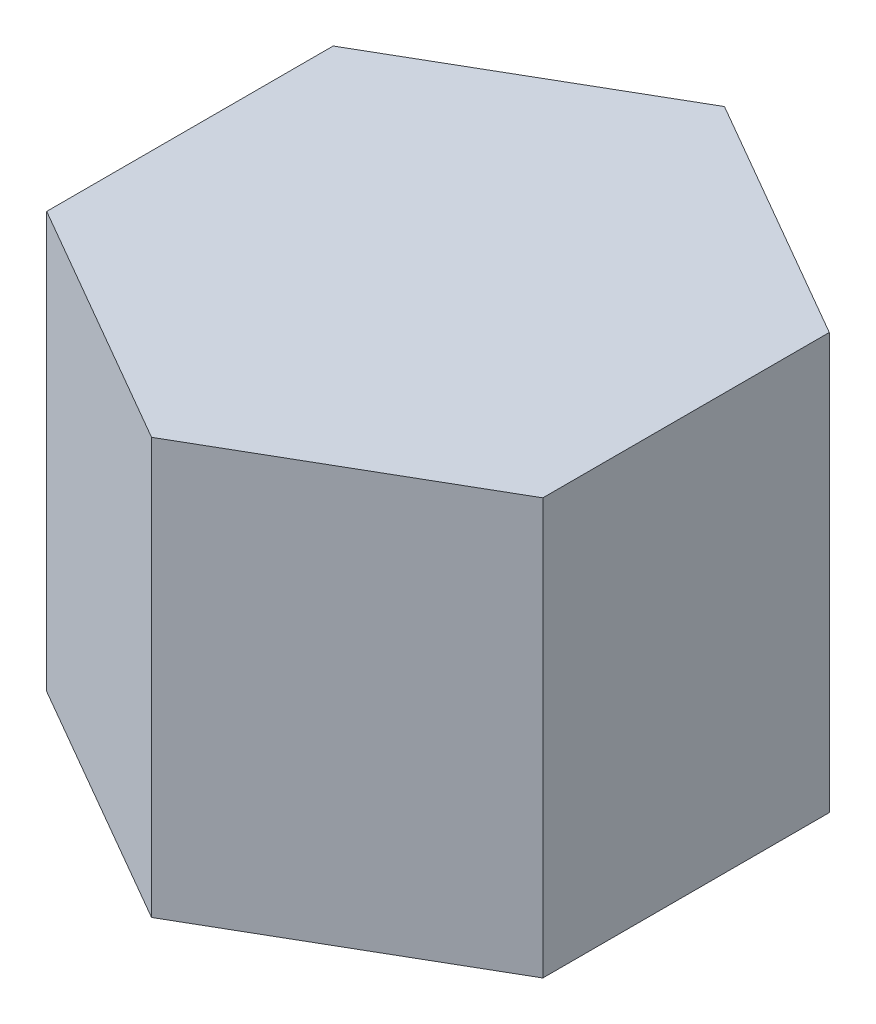
ISO-10303-21;
HEADER;
FILE_DESCRIPTION(('STEP AP214'),'2;1');
FILE_NAME('part.step','',(''),(''),'','','');
FILE_SCHEMA(('AUTOMOTIVE_DESIGN { 1 0 10303 214 1 1 1 1 }'));
ENDSEC;
DATA;
#1=APPLICATION_CONTEXT('core data for automotive mechanical design processes');
#2=APPLICATION_PROTOCOL_DEFINITION('international standard','automotive_design',2000,#1);
#3=PRODUCT_CONTEXT('',#1,'mechanical');
#4=PRODUCT('Part','Part','',(#3));
#5=PRODUCT_RELATED_PRODUCT_CATEGORY('part','',(#4));
#6=PRODUCT_DEFINITION_FORMATION('','',#4);
#7=PRODUCT_DEFINITION_CONTEXT('part definition',#1,'design');
#8=PRODUCT_DEFINITION('design','',#6,#7);
#9=PRODUCT_DEFINITION_SHAPE('','',#8);
#10=(LENGTH_UNIT() NAMED_UNIT(*) SI_UNIT(.MILLI.,.METRE.));
#11=(NAMED_UNIT(*) PLANE_ANGLE_UNIT() SI_UNIT($,.RADIAN.));
#12=(NAMED_UNIT(*) SI_UNIT($,.STERADIAN.) SOLID_ANGLE_UNIT());
#13=UNCERTAINTY_MEASURE_WITH_UNIT(LENGTH_MEASURE(1.E-05),#10,'distance_accuracy_value','');
#14=(GEOMETRIC_REPRESENTATION_CONTEXT(3) GLOBAL_UNCERTAINTY_ASSIGNED_CONTEXT((#13)) GLOBAL_UNIT_ASSIGNED_CONTEXT((#10,
#11,#12)) REPRESENTATION_CONTEXT('',''));
#15=CARTESIAN_POINT('',(0.,0.,0.));
#16=DIRECTION('',(0.,0.,1.));
#17=DIRECTION('',(1.,0.,0.));
#18=AXIS2_PLACEMENT_3D('',#15,#16,#17);
#19=CARTESIAN_POINT('',(207.642660308706,-148.537700895744,289.774920412926));
#20=DIRECTION('',(-0.499999999999943,0.,-0.866025403784472));
#21=DIRECTION('',(-0.866025403784472,0.,0.499999999999943));
#22=AXIS2_PLACEMENT_3D('',#19,#20,#21);
#23=PLANE('',#22);
#24=CARTESIAN_POINT('',(207.339551417382,-149.045793579175,289.949920412926));
#25=DIRECTION('',(0.866025403784471,0.,-0.499999999999943));
#26=VECTOR('',#25,1.);
#27=LINE('',#24,#26);
#28=CARTESIAN_POINT('',(207.339551417382,-149.045793579175,289.949920412926));
#29=VERTEX_POINT('',#28);
#30=CARTESIAN_POINT('',(207.642660308706,-149.045793579175,289.774920412926));
#31=VERTEX_POINT('',#30);
#32=EDGE_CURVE('E170',#29,#31,#27,.T.);
#33=ORIENTED_EDGE('',*,*,#32,.T.);
#34=CARTESIAN_POINT('',(207.642660308706,-148.537700895744,289.774920412926));
#35=DIRECTION('',(0.,-1.,0.));
#36=VECTOR('',#35,1.);
#37=LINE('',#34,#36);
#38=CARTESIAN_POINT('',(207.642660308706,-148.537700895744,289.774920412926));
#39=VERTEX_POINT('',#38);
#40=EDGE_CURVE('E35',#39,#31,#37,.T.);
#41=ORIENTED_EDGE('',*,*,#40,.F.);
#42=CARTESIAN_POINT('',(207.339551417382,-148.537700895744,289.949920412926));
#43=DIRECTION('',(0.866025403784471,0.,-0.499999999999943));
#44=VECTOR('',#43,1.);
#45=LINE('',#42,#44);
#46=CARTESIAN_POINT('',(207.339551417382,-148.537700895744,289.949920412926));
#47=VERTEX_POINT('',#46);
#48=EDGE_CURVE('E159',#47,#39,#45,.T.);
#49=ORIENTED_EDGE('',*,*,#48,.F.);
#50=CARTESIAN_POINT('',(207.339551417382,-148.537700895744,289.949920412926));
#51=DIRECTION('',(0.,-1.,0.));
#52=VECTOR('',#51,1.);
#53=LINE('',#50,#52);
#54=EDGE_CURVE('E10',#47,#29,#53,.T.);
#55=ORIENTED_EDGE('',*,*,#54,.T.);
#56=EDGE_LOOP('',(#33,#41,#49,#55));
#57=FACE_BOUND('',#56,.T.);
#58=ADVANCED_FACE('F16',(#57),#23,.F.);
#59=CARTESIAN_POINT('',(207.339551417382,-148.537700895744,289.949920412926));
#60=DIRECTION('',(0.499999999999978,0.,-0.866025403784452));
#61=DIRECTION('',(-0.866025403784452,0.,-0.499999999999978));
#62=AXIS2_PLACEMENT_3D('',#59,#60,#61);
#63=PLANE('',#62);
#64=CARTESIAN_POINT('',(207.036442526057,-149.045793579175,289.774920412926));
#65=DIRECTION('',(0.866025403784452,0.,0.499999999999978));
#66=VECTOR('',#65,1.);
#67=LINE('',#64,#66);
#68=CARTESIAN_POINT('',(207.036442526057,-149.045793579175,289.774920412926));
#69=VERTEX_POINT('',#68);
#70=EDGE_CURVE('E167',#69,#29,#67,.T.);
#71=ORIENTED_EDGE('',*,*,#70,.T.);
#72=ORIENTED_EDGE('',*,*,#54,.F.);
#73=CARTESIAN_POINT('',(207.036442526057,-148.537700895744,289.774920412926));
#74=DIRECTION('',(0.866025403784452,0.,0.499999999999978));
#75=VECTOR('',#74,1.);
#76=LINE('',#73,#75);
#77=CARTESIAN_POINT('',(207.036442526057,-148.537700895744,289.774920412926));
#78=VERTEX_POINT('',#77);
#79=EDGE_CURVE('E156',#78,#47,#76,.T.);
#80=ORIENTED_EDGE('',*,*,#79,.F.);
#81=CARTESIAN_POINT('',(207.036442526057,-148.537700895744,289.774920412926));
#82=DIRECTION('',(0.,-1.,0.));
#83=VECTOR('',#82,1.);
#84=LINE('',#81,#83);
#85=EDGE_CURVE('E27',#78,#69,#84,.T.);
#86=ORIENTED_EDGE('',*,*,#85,.T.);
#87=EDGE_LOOP('',(#71,#72,#80,#86));
#88=FACE_BOUND('',#87,.T.);
#89=ADVANCED_FACE('F189',(#88),#63,.F.);
#90=CARTESIAN_POINT('',(207.036442526057,-148.537700895744,290.831971220494));
#91=DIRECTION('',(1.,0.,0.));
#92=DIRECTION('',(0.,1.,0.));
#93=AXIS2_PLACEMENT_3D('',#90,#91,#92);
#94=PLANE('',#93);
#95=CARTESIAN_POINT('',(207.036442526057,-149.045793579175,289.424920412926));
#96=DIRECTION('',(0.,0.,1.));
#97=VECTOR('',#96,1.);
#98=LINE('',#95,#97);
#99=CARTESIAN_POINT('',(207.036442526057,-149.045793579175,289.424920412926));
#100=VERTEX_POINT('',#99);
#101=EDGE_CURVE('E163',#100,#69,#98,.T.);
#102=ORIENTED_EDGE('',*,*,#101,.T.);
#103=ORIENTED_EDGE('',*,*,#85,.F.);
#104=CARTESIAN_POINT('',(207.036442526057,-148.537700895744,289.424920412926));
#105=DIRECTION('',(0.,0.,1.));
#106=VECTOR('',#105,1.);
#107=LINE('',#104,#106);
#108=CARTESIAN_POINT('',(207.036442526057,-148.537700895744,289.424920412926));
#109=VERTEX_POINT('',#108);
#110=EDGE_CURVE('E106',#109,#78,#107,.T.);
#111=ORIENTED_EDGE('',*,*,#110,.F.);
#112=CARTESIAN_POINT('',(207.036442526057,-148.537700895744,289.424920412926));
#113=DIRECTION('',(0.,-1.,0.));
#114=VECTOR('',#113,1.);
#115=LINE('',#112,#114);
#116=EDGE_CURVE('E94',#109,#100,#115,.T.);
#117=ORIENTED_EDGE('',*,*,#116,.T.);
#118=EDGE_LOOP('',(#102,#103,#111,#117));
#119=FACE_BOUND('',#118,.T.);
#120=ADVANCED_FACE('F198',(#119),#94,.F.);
#121=CARTESIAN_POINT('',(207.036442526057,-148.537700895744,289.424920412926));
#122=DIRECTION('',(0.499999999999978,0.,0.866025403784452));
#123=DIRECTION('',(0.866025403784452,0.,-0.499999999999978));
#124=AXIS2_PLACEMENT_3D('',#121,#122,#123);
#125=PLANE('',#124);
#126=CARTESIAN_POINT('',(207.339551417382,-149.045793579175,289.249920412926));
#127=DIRECTION('',(-0.866025403784452,0.,0.499999999999978));
#128=VECTOR('',#127,1.);
#129=LINE('',#126,#128);
#130=CARTESIAN_POINT('',(207.339551417382,-149.045793579175,289.249920412926));
#131=VERTEX_POINT('',#130);
#132=EDGE_CURVE('E162',#131,#100,#129,.T.);
#133=ORIENTED_EDGE('',*,*,#132,.T.);
#134=ORIENTED_EDGE('',*,*,#116,.F.);
#135=CARTESIAN_POINT('',(207.339551417382,-148.537700895744,289.249920412926));
#136=DIRECTION('',(-0.866025403784452,0.,0.499999999999978));
#137=VECTOR('',#136,1.);
#138=LINE('',#135,#137);
#139=CARTESIAN_POINT('',(207.339551417382,-148.537700895744,289.249920412926));
#140=VERTEX_POINT('',#139);
#141=EDGE_CURVE('E98',#140,#109,#138,.T.);
#142=ORIENTED_EDGE('',*,*,#141,.F.);
#143=CARTESIAN_POINT('',(207.339551417382,-148.537700895744,289.249920412926));
#144=DIRECTION('',(0.,-1.,0.));
#145=VECTOR('',#144,1.);
#146=LINE('',#143,#145);
#147=EDGE_CURVE('E79',#140,#131,#146,.T.);
#148=ORIENTED_EDGE('',*,*,#147,.T.);
#149=EDGE_LOOP('',(#133,#134,#142,#148));
#150=FACE_BOUND('',#149,.T.);
#151=ADVANCED_FACE('F100',(#150),#125,.F.);
#152=CARTESIAN_POINT('',(207.339551417382,-148.537700895744,289.249920412926));
#153=DIRECTION('',(-0.499999999999943,0.,0.866025403784472));
#154=DIRECTION('',(0.866025403784472,0.,0.499999999999943));
#155=AXIS2_PLACEMENT_3D('',#152,#153,#154);
#156=PLANE('',#155);
#157=CARTESIAN_POINT('',(207.642660308706,-149.045793579175,289.424920412926));
#158=DIRECTION('',(-0.866025403784471,0.,-0.499999999999943));
#159=VECTOR('',#158,1.);
#160=LINE('',#157,#159);
#161=CARTESIAN_POINT('',(207.642660308706,-149.045793579175,289.424920412926));
#162=VERTEX_POINT('',#161);
#163=EDGE_CURVE('E88',#162,#131,#160,.T.);
#164=ORIENTED_EDGE('',*,*,#163,.T.);
#165=ORIENTED_EDGE('',*,*,#147,.F.);
#166=CARTESIAN_POINT('',(207.642660308706,-148.537700895744,289.424920412926));
#167=DIRECTION('',(-0.866025403784471,0.,-0.499999999999943));
#168=VECTOR('',#167,1.);
#169=LINE('',#166,#168);
#170=CARTESIAN_POINT('',(207.642660308706,-148.537700895744,289.424920412926));
#171=VERTEX_POINT('',#170);
#172=EDGE_CURVE('E84',#171,#140,#169,.T.);
#173=ORIENTED_EDGE('',*,*,#172,.F.);
#174=CARTESIAN_POINT('',(207.642660308706,-148.537700895744,289.424920412926));
#175=DIRECTION('',(0.,-1.,0.));
#176=VECTOR('',#175,1.);
#177=LINE('',#174,#176);
#178=EDGE_CURVE('E58',#171,#162,#177,.T.);
#179=ORIENTED_EDGE('',*,*,#178,.T.);
#180=EDGE_LOOP('',(#164,#165,#173,#179));
#181=FACE_BOUND('',#180,.T.);
#182=ADVANCED_FACE('F82',(#181),#156,.F.);
#183=CARTESIAN_POINT('',(207.642660308706,-148.537700895744,290.831971220494));
#184=DIRECTION('',(-1.,0.,0.));
#185=DIRECTION('',(0.,-1.,0.));
#186=AXIS2_PLACEMENT_3D('',#183,#184,#185);
#187=PLANE('',#186);
#188=CARTESIAN_POINT('',(207.642660308706,-149.045793579175,289.774920412926));
#189=DIRECTION('',(0.,0.,-1.));
#190=VECTOR('',#189,1.);
#191=LINE('',#188,#190);
#192=EDGE_CURVE('E160',#31,#162,#191,.T.);
#193=ORIENTED_EDGE('',*,*,#192,.T.);
#194=ORIENTED_EDGE('',*,*,#178,.F.);
#195=CARTESIAN_POINT('',(207.642660308706,-148.537700895744,289.774920412926));
#196=DIRECTION('',(0.,0.,-1.));
#197=VECTOR('',#196,1.);
#198=LINE('',#195,#197);
#199=EDGE_CURVE('E112',#39,#171,#198,.T.);
#200=ORIENTED_EDGE('',*,*,#199,.F.);
#201=ORIENTED_EDGE('',*,*,#40,.T.);
#202=EDGE_LOOP('',(#193,#194,#200,#201));
#203=FACE_BOUND('',#202,.T.);
#204=ADVANCED_FACE('F131',(#203),#187,.F.);
#205=CARTESIAN_POINT('',(206.339551417382,-148.537700895744,290.831971220494));
#206=DIRECTION('',(0.,-1.,0.));
#207=DIRECTION('',(1.,0.,0.));
#208=AXIS2_PLACEMENT_3D('',#205,#206,#207);
#209=PLANE('',#208);
#210=ORIENTED_EDGE('',*,*,#48,.T.);
#211=ORIENTED_EDGE('',*,*,#199,.T.);
#212=ORIENTED_EDGE('',*,*,#172,.T.);
#213=ORIENTED_EDGE('',*,*,#141,.T.);
#214=ORIENTED_EDGE('',*,*,#110,.T.);
#215=ORIENTED_EDGE('',*,*,#79,.T.);
#216=EDGE_LOOP('',(#210,#211,#212,#213,#214,#215));
#217=FACE_BOUND('',#216,.T.);
#218=ADVANCED_FACE('F111',(#217),#209,.F.);
#219=CARTESIAN_POINT('',(206.339551417382,-149.045793579175,290.831971220494));
#220=DIRECTION('',(0.,-1.,0.));
#221=DIRECTION('',(1.,0.,0.));
#222=AXIS2_PLACEMENT_3D('',#219,#220,#221);
#223=PLANE('',#222);
#224=ORIENTED_EDGE('',*,*,#32,.F.);
#225=ORIENTED_EDGE('',*,*,#70,.F.);
#226=ORIENTED_EDGE('',*,*,#101,.F.);
#227=ORIENTED_EDGE('',*,*,#132,.F.);
#228=ORIENTED_EDGE('',*,*,#163,.F.);
#229=ORIENTED_EDGE('',*,*,#192,.F.);
#230=EDGE_LOOP('',(#224,#225,#226,#227,#228,#229));
#231=FACE_BOUND('',#230,.T.);
#232=ADVANCED_FACE('F130',(#231),#223,.T.);
#233=CLOSED_SHELL('',(#58,#89,#120,#151,#182,#204,#218,#232));
#234=MANIFOLD_SOLID_BREP('B1',#233);
#235=ADVANCED_BREP_SHAPE_REPRESENTATION('',(#18,#234),#14);
#236=SHAPE_DEFINITION_REPRESENTATION(#9,#235);
ENDSEC;
END-ISO-10303-21;
